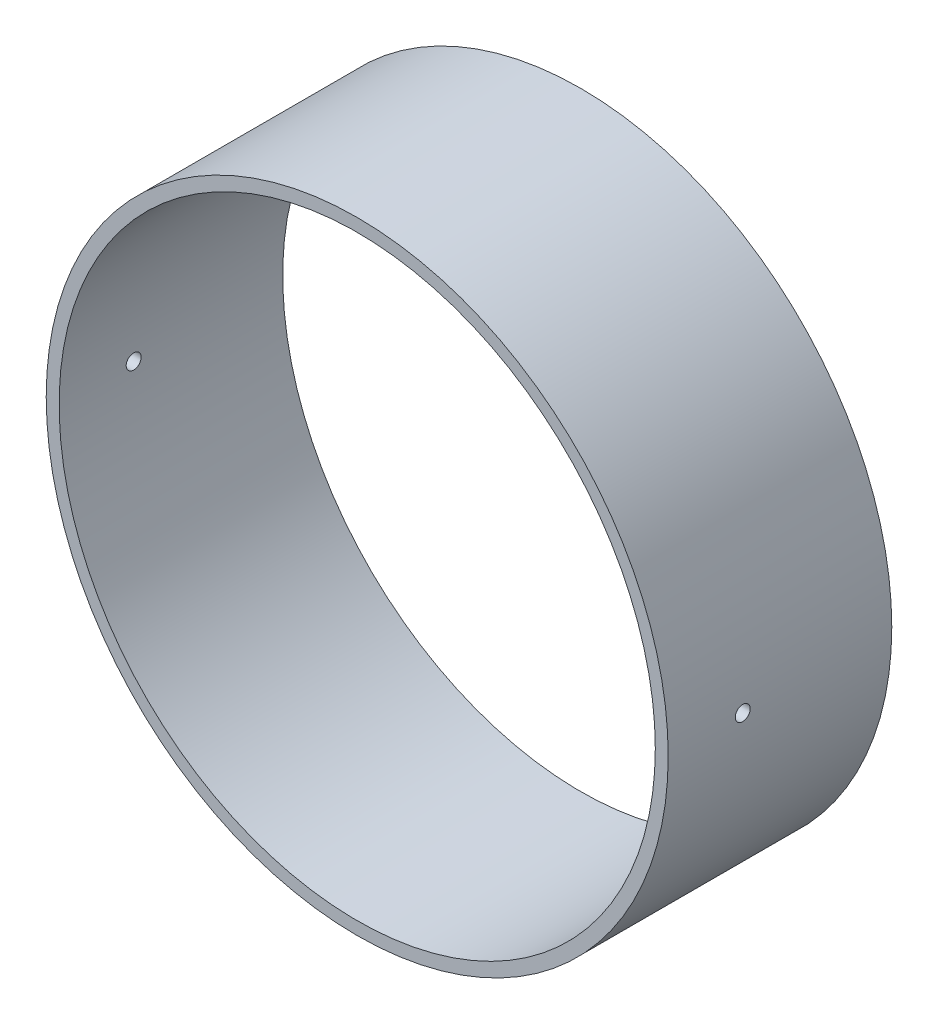
ISO-10303-21;
HEADER;
FILE_DESCRIPTION(('STEP AP214'),'2;1');
FILE_NAME('part.step','',(''),(''),'','','');
FILE_SCHEMA(('AUTOMOTIVE_DESIGN { 1 0 10303 214 1 1 1 1 }'));
ENDSEC;
DATA;
#1=APPLICATION_CONTEXT('core data for automotive mechanical design processes');
#2=APPLICATION_PROTOCOL_DEFINITION('international standard','automotive_design',2000,#1);
#3=PRODUCT_CONTEXT('',#1,'mechanical');
#4=PRODUCT('Part','Part','',(#3));
#5=PRODUCT_RELATED_PRODUCT_CATEGORY('part','',(#4));
#6=PRODUCT_DEFINITION_FORMATION('','',#4);
#7=PRODUCT_DEFINITION_CONTEXT('part definition',#1,'design');
#8=PRODUCT_DEFINITION('design','',#6,#7);
#9=PRODUCT_DEFINITION_SHAPE('','',#8);
#10=(LENGTH_UNIT() NAMED_UNIT(*) SI_UNIT(.MILLI.,.METRE.));
#11=(NAMED_UNIT(*) PLANE_ANGLE_UNIT() SI_UNIT($,.RADIAN.));
#12=(NAMED_UNIT(*) SI_UNIT($,.STERADIAN.) SOLID_ANGLE_UNIT());
#13=UNCERTAINTY_MEASURE_WITH_UNIT(LENGTH_MEASURE(1.E-05),#10,'distance_accuracy_value','');
#14=(GEOMETRIC_REPRESENTATION_CONTEXT(3) GLOBAL_UNCERTAINTY_ASSIGNED_CONTEXT((#13)) GLOBAL_UNIT_ASSIGNED_CONTEXT((#10,
#11,#12)) REPRESENTATION_CONTEXT('',''));
#15=CARTESIAN_POINT('',(0.,0.,0.));
#16=DIRECTION('',(0.,0.,1.));
#17=DIRECTION('',(1.,0.,0.));
#18=AXIS2_PLACEMENT_3D('',#15,#16,#17);
#19=CARTESIAN_POINT('',(0.,0.,28.575));
#20=DIRECTION('',(0.,0.,1.));
#21=DIRECTION('',(1.,0.,0.));
#22=AXIS2_PLACEMENT_3D('',#19,#20,#21);
#23=PLANE('',#22);
#24=CARTESIAN_POINT('',(0.,0.,28.575));
#25=DIRECTION('',(0.,0.,1.));
#26=DIRECTION('',(1.,0.,0.));
#27=AXIS2_PLACEMENT_3D('',#24,#25,#26);
#28=CIRCLE('',#27,39.75);
#29=CARTESIAN_POINT('',(39.75,0.,28.575));
#30=VERTEX_POINT('',#29);
#31=EDGE_CURVE('E10',#30,#30,#28,.T.);
#32=ORIENTED_EDGE('',*,*,#31,.T.);
#33=EDGE_LOOP('',(#32));
#34=FACE_BOUND('',#33,.T.);
#35=CARTESIAN_POINT('',(0.,0.,28.575));
#36=DIRECTION('',(0.,0.,1.));
#37=DIRECTION('',(1.,0.,0.));
#38=AXIS2_PLACEMENT_3D('',#35,#36,#37);
#39=CIRCLE('',#38,38.1);
#40=CARTESIAN_POINT('',(38.1,0.,28.575));
#41=VERTEX_POINT('',#40);
#42=EDGE_CURVE('E53',#41,#41,#39,.T.);
#43=ORIENTED_EDGE('',*,*,#42,.F.);
#44=EDGE_LOOP('',(#43));
#45=FACE_BOUND('',#44,.T.);
#46=ADVANCED_FACE('F34',(#34,#45),#23,.T.);
#47=CARTESIAN_POINT('',(0.,0.,0.));
#48=DIRECTION('',(0.,0.,1.));
#49=DIRECTION('',(1.,0.,0.));
#50=AXIS2_PLACEMENT_3D('',#47,#48,#49);
#51=PLANE('',#50);
#52=CARTESIAN_POINT('',(0.,0.,0.));
#53=DIRECTION('',(0.,0.,1.));
#54=DIRECTION('',(1.,0.,0.));
#55=AXIS2_PLACEMENT_3D('',#52,#53,#54);
#56=CIRCLE('',#55,39.75);
#57=CARTESIAN_POINT('',(39.75,0.,0.));
#58=VERTEX_POINT('',#57);
#59=EDGE_CURVE('E48',#58,#58,#56,.T.);
#60=ORIENTED_EDGE('',*,*,#59,.F.);
#61=EDGE_LOOP('',(#60));
#62=FACE_BOUND('',#61,.T.);
#63=CARTESIAN_POINT('',(0.,0.,0.));
#64=DIRECTION('',(0.,0.,1.));
#65=DIRECTION('',(1.,0.,0.));
#66=AXIS2_PLACEMENT_3D('',#63,#64,#65);
#67=CIRCLE('',#66,38.1);
#68=CARTESIAN_POINT('',(38.1,0.,0.));
#69=VERTEX_POINT('',#68);
#70=EDGE_CURVE('E56',#69,#69,#67,.T.);
#71=ORIENTED_EDGE('',*,*,#70,.T.);
#72=EDGE_LOOP('',(#71));
#73=FACE_BOUND('',#72,.T.);
#74=ADVANCED_FACE('F92',(#62,#73),#51,.F.);
#75=CARTESIAN_POINT('',(0.,0.,28.575));
#76=DIRECTION('',(0.,0.,-1.));
#77=DIRECTION('',(-1.,0.,0.));
#78=AXIS2_PLACEMENT_3D('',#75,#76,#77);
#79=CYLINDRICAL_SURFACE('',#78,39.75);
#80=CARTESIAN_POINT('',(39.75,0.,20.0025));
#81=CARTESIAN_POINT('',(39.7499998460365,0.053494104663573,20.0024976302836));
#82=CARTESIAN_POINT('',(39.7498908555501,0.107026802117876,19.9979783883989));
#83=CARTESIAN_POINT('',(39.7494665485141,0.212617313597878,19.9800132651465));
#84=CARTESIAN_POINT('',(39.7491509848299,0.264673283008032,19.9665566912854));
#85=CARTESIAN_POINT('',(39.7483492722617,0.365765353174802,19.9311007087586));
#86=CARTESIAN_POINT('',(39.7478632061248,0.414802905265441,19.9091054434863));
#87=CARTESIAN_POINT('',(39.7467753330846,0.508475773654119,19.8572022954957));
#88=CARTESIAN_POINT('',(39.7461735546353,0.553112168139593,19.8272963573639));
#89=CARTESIAN_POINT('',(39.7449217984111,0.636744787477263,19.760408393355));
#90=CARTESIAN_POINT('',(39.744271807001,0.675739407496198,19.7234243609975));
#91=CARTESIAN_POINT('',(39.7429970046479,0.746968176136346,19.6434332203757));
#92=CARTESIAN_POINT('',(39.7423721947034,0.779202056879612,19.6004258735646));
#93=CARTESIAN_POINT('',(39.7412181644531,0.835995645710772,19.5096045128951));
#94=CARTESIAN_POINT('',(39.7406889538771,0.860554572850182,19.4617900105487));
#95=CARTESIAN_POINT('',(39.7397858982121,0.901295957044684,19.3627151380246));
#96=CARTESIAN_POINT('',(39.7394120526126,0.917478441626887,19.3114547791715));
#97=CARTESIAN_POINT('',(39.7388619640907,0.941004629387772,19.2069537232027));
#98=CARTESIAN_POINT('',(39.738685683097,0.948350035519394,19.1537134096744));
#99=CARTESIAN_POINT('',(39.7385504850494,0.953998796121277,19.0467551065655));
#100=CARTESIAN_POINT('',(39.7385915673001,0.952302179515943,18.9930371185135));
#101=CARTESIAN_POINT('',(39.738886427485,0.939916515238613,18.8866598825534));
#102=CARTESIAN_POINT('',(39.7391401617592,0.929229313435194,18.8340004195903));
#103=CARTESIAN_POINT('',(39.7398316528361,0.899168700884327,18.7312232708817));
#104=CARTESIAN_POINT('',(39.7402694099676,0.879795274613089,18.6811055896789));
#105=CARTESIAN_POINT('',(39.7412796470828,0.832910038955143,18.584828760083));
#106=CARTESIAN_POINT('',(39.7418521410799,0.805397382961803,18.5386700241264));
#107=CARTESIAN_POINT('',(39.7430672972813,0.743015313990828,18.4516259072517));
#108=CARTESIAN_POINT('',(39.7437099595777,0.708145891364704,18.4107405332498));
#109=CARTESIAN_POINT('',(39.7449931969159,0.632029655786516,18.335392965578));
#110=CARTESIAN_POINT('',(39.7456337713918,0.590781240555827,18.3009323905022));
#111=CARTESIAN_POINT('',(39.7468404620925,0.503083577535561,18.2394250992597));
#112=CARTESIAN_POINT('',(39.7474065783063,0.45663432896882,18.2123783842009));
#113=CARTESIAN_POINT('',(39.7484005376143,0.359852650913566,18.1664667675409));
#114=CARTESIAN_POINT('',(39.7488283798699,0.309520197873244,18.1476019155676));
#115=CARTESIAN_POINT('',(39.7494975460588,0.206401283685805,18.118590563217));
#116=CARTESIAN_POINT('',(39.749738870319,0.153614826840126,18.1084440475586));
#117=CARTESIAN_POINT('',(39.7500077544224,0.0471004004104377,18.0971593736529));
#118=CARTESIAN_POINT('',(39.7500353674039,-0.00662733180007495,18.0960189760795));
#119=CARTESIAN_POINT('',(39.7498738568161,-0.113511507883781,18.1027730765356));
#120=CARTESIAN_POINT('',(39.7496847334035,-0.166667952169796,18.1106675680359));
#121=CARTESIAN_POINT('',(39.7491111015279,-0.270894381174725,18.135265495612));
#122=CARTESIAN_POINT('',(39.748726615588,-0.321964605679448,18.1519679162357));
#123=CARTESIAN_POINT('',(39.7478055924139,-0.420576236824629,18.193706544643));
#124=CARTESIAN_POINT('',(39.7472690549916,-0.468117639102438,18.2187427627294));
#125=CARTESIAN_POINT('',(39.7461042557672,-0.55833239751617,18.276444063584));
#126=CARTESIAN_POINT('',(39.7454759758439,-0.601004788942966,18.3091106542834));
#127=CARTESIAN_POINT('',(39.7441985687771,-0.680260520118648,18.3811431955905));
#128=CARTESIAN_POINT('',(39.7435494415964,-0.716843849058312,18.4205091580906));
#129=CARTESIAN_POINT('',(39.7423033692423,-0.782890439107276,18.5048325660628));
#130=CARTESIAN_POINT('',(39.7417064346742,-0.812352255283334,18.5497911434614));
#131=CARTESIAN_POINT('',(39.7406322155955,-0.863309610126898,18.6440177548333));
#132=CARTESIAN_POINT('',(39.740154930867,-0.884805163297402,18.6932857809608));
#133=CARTESIAN_POINT('',(39.7393738988802,-0.919217286930498,18.7947272918023));
#134=CARTESIAN_POINT('',(39.7390701326409,-0.932134795759579,18.8469004580414));
#135=CARTESIAN_POINT('',(39.7386703324535,-0.949027230103611,18.952675787155));
#136=CARTESIAN_POINT('',(39.7385742985246,-0.95300215479436,19.0062779501613));
#137=CARTESIAN_POINT('',(39.7386007975025,-0.951896465994101,19.1133751589298));
#138=CARTESIAN_POINT('',(39.738723275277,-0.946818136715644,19.1668702283035));
#139=CARTESIAN_POINT('',(39.7391728744335,-0.927754779863062,19.2722483061791));
#140=CARTESIAN_POINT('',(39.7394999962235,-0.913769734530126,19.3241313114665));
#141=CARTESIAN_POINT('',(39.7403220002089,-0.877290123585656,19.4248136666695));
#142=CARTESIAN_POINT('',(39.7408168853695,-0.854795407564792,19.4736129620625));
#143=CARTESIAN_POINT('',(39.7419186022703,-0.801936135858363,19.5667410101382));
#144=CARTESIAN_POINT('',(39.7425254298364,-0.771571873596423,19.6110699294177));
#145=CARTESIAN_POINT('',(39.7437827568947,-0.703830052350616,19.6940085564152));
#146=CARTESIAN_POINT('',(39.7444332627452,-0.666451470854739,19.7326174288234));
#147=CARTESIAN_POINT('',(39.7457047180014,-0.585732141955894,19.8030222194704));
#148=CARTESIAN_POINT('',(39.7463256600385,-0.542389918534343,19.8348164460662));
#149=CARTESIAN_POINT('',(39.7474681589653,-0.450960100766693,19.8906929330673));
#150=CARTESIAN_POINT('',(39.7479896573869,-0.40286973980615,19.9147706621693));
#151=CARTESIAN_POINT('',(39.7488733756499,-0.303365300168541,19.9544825926952));
#152=CARTESIAN_POINT('',(39.7492357856961,-0.251955275314471,19.970126882199));
#153=CARTESIAN_POINT('',(39.74966342885,-0.166849540723217,19.9883733944774));
#154=CARTESIAN_POINT('',(39.7497890968184,-0.133706454605323,19.9936642255806));
#155=CARTESIAN_POINT('',(39.7499574306394,-0.0670473000409005,20.0007282707082));
#156=CARTESIAN_POINT('',(39.7500000965076,-0.0335312316638731,20.0025014853881));
#157=CARTESIAN_POINT('',(39.75,0.,20.0025));
#158=B_SPLINE_CURVE_WITH_KNOTS('',3,(#80,#81,#82,#83,#84,#85,#86,#87,#88,#89,#90,#91,#92,#93,
#94,#95,#96,#97,#98,#99,#100,#101,#102,#103,#104,#105,#106,#107,#108,#109,#110,#111,#112,#113,
#114,#115,#116,#117,#118,#119,#120,#121,#122,#123,#124,#125,#126,#127,#128,#129,#130,#131,#132,
#133,#134,#135,#136,#137,#138,#139,#140,#141,#142,#143,#144,#145,#146,#147,#148,#149,#150,#151,
#152,#153,#154,#155,#156,#157),.UNSPECIFIED.,.T.,.F.,(4,2,2,2,2,2,2,2,2,2,2,2,2,2,2,2,2,2,2,2,2,
2,2,2,2,2,2,2,2,2,2,2,2,2,2,2,2,2,4),(0.,0.160359922254081,0.320912043203712,0.481386353547739,
0.641821253005189,0.802301699688268,0.962788503820298,1.12329163263074,1.28379423398393,
1.44426590065867,1.60473705400308,1.76517526884771,1.92561377042442,2.08606896597464,
2.24652437196514,2.40702014688433,2.56751594578658,2.72801271817964,2.88850920926067,
3.04896579243571,3.20942225965442,3.36986023214588,3.53029840298194,3.69076830683191,
3.85123849554285,4.01174121588789,4.17224364402792,4.33272851164775,4.49321339405882,
4.65365779050726,4.81410250686156,4.97455005922573,5.13499163000856,5.29545660734695,
5.4559613719104,5.61656021656189,5.77696652418033,5.87748352018328,5.97800049745618),.UNSPECIFIED.);
#159=CARTESIAN_POINT('',(39.75,0.,20.0025));
#160=VERTEX_POINT('',#159);
#161=EDGE_CURVE('E81',#160,#160,#158,.T.);
#162=ORIENTED_EDGE('',*,*,#161,.T.);
#163=EDGE_LOOP('',(#162));
#164=FACE_BOUND('',#163,.T.);
#165=CARTESIAN_POINT('',(-39.75,0.,20.0025));
#166=CARTESIAN_POINT('',(-39.7499998460365,-0.0534941046635731,20.0024976302836));
#167=CARTESIAN_POINT('',(-39.7498908555501,-0.107026802117876,19.9979783883989));
#168=CARTESIAN_POINT('',(-39.7494665485141,-0.212617313597879,19.9800132651465));
#169=CARTESIAN_POINT('',(-39.7491509848299,-0.264673283008033,19.9665566912854));
#170=CARTESIAN_POINT('',(-39.7483492722617,-0.365765353174802,19.9311007087586));
#171=CARTESIAN_POINT('',(-39.7478632061248,-0.414802905265441,19.9091054434863));
#172=CARTESIAN_POINT('',(-39.7467753330846,-0.50847577365412,19.8572022954957));
#173=CARTESIAN_POINT('',(-39.7461735546353,-0.553112168139594,19.8272963573639));
#174=CARTESIAN_POINT('',(-39.7449217984111,-0.636744787477264,19.760408393355));
#175=CARTESIAN_POINT('',(-39.744271807001,-0.675739407496199,19.7234243609975));
#176=CARTESIAN_POINT('',(-39.7429970046479,-0.746968176136347,19.6434332203757));
#177=CARTESIAN_POINT('',(-39.7423721947034,-0.779202056879612,19.6004258735646));
#178=CARTESIAN_POINT('',(-39.7412181644531,-0.835995645710773,19.5096045128951));
#179=CARTESIAN_POINT('',(-39.7406889538771,-0.860554572850184,19.4617900105487));
#180=CARTESIAN_POINT('',(-39.7397858982121,-0.901295957044687,19.3627151380246));
#181=CARTESIAN_POINT('',(-39.7394120526126,-0.917478441626889,19.3114547791715));
#182=CARTESIAN_POINT('',(-39.7388619640907,-0.941004629387772,19.2069537232027));
#183=CARTESIAN_POINT('',(-39.738685683097,-0.948350035519394,19.1537134096744));
#184=CARTESIAN_POINT('',(-39.7385504850494,-0.953998796121277,19.0467551065655));
#185=CARTESIAN_POINT('',(-39.7385915673001,-0.952302179515943,18.9930371185135));
#186=CARTESIAN_POINT('',(-39.738886427485,-0.939916515238613,18.8866598825534));
#187=CARTESIAN_POINT('',(-39.7391401617592,-0.929229313435194,18.8340004195903));
#188=CARTESIAN_POINT('',(-39.7398316528361,-0.899168700884327,18.7312232708817));
#189=CARTESIAN_POINT('',(-39.7402694099676,-0.879795274613089,18.6811055896789));
#190=CARTESIAN_POINT('',(-39.7412796470828,-0.832910038955143,18.584828760083));
#191=CARTESIAN_POINT('',(-39.7418521410799,-0.805397382961803,18.5386700241264));
#192=CARTESIAN_POINT('',(-39.7430672972813,-0.743015313990828,18.4516259072517));
#193=CARTESIAN_POINT('',(-39.7437099595777,-0.708145891364704,18.4107405332498));
#194=CARTESIAN_POINT('',(-39.7449931969159,-0.632029655786516,18.335392965578));
#195=CARTESIAN_POINT('',(-39.7456337713918,-0.590781240555827,18.3009323905022));
#196=CARTESIAN_POINT('',(-39.7468404620925,-0.503083577535561,18.2394250992597));
#197=CARTESIAN_POINT('',(-39.7474065783063,-0.45663432896882,18.2123783842009));
#198=CARTESIAN_POINT('',(-39.7484005376143,-0.359852650913566,18.1664667675409));
#199=CARTESIAN_POINT('',(-39.7488283798699,-0.309520197873244,18.1476019155676));
#200=CARTESIAN_POINT('',(-39.7494975460588,-0.206401283685805,18.118590563217));
#201=CARTESIAN_POINT('',(-39.749738870319,-0.153614826840126,18.1084440475586));
#202=CARTESIAN_POINT('',(-39.7500077544224,-0.0471004004104377,18.0971593736529));
#203=CARTESIAN_POINT('',(-39.7500353674039,0.00662733180007494,18.0960189760795));
#204=CARTESIAN_POINT('',(-39.7498738568161,0.113511507883781,18.1027730765356));
#205=CARTESIAN_POINT('',(-39.7496847334035,0.166667952169796,18.1106675680359));
#206=CARTESIAN_POINT('',(-39.7491111015279,0.270894381174725,18.135265495612));
#207=CARTESIAN_POINT('',(-39.748726615588,0.321964605679448,18.1519679162357));
#208=CARTESIAN_POINT('',(-39.7478055924139,0.420576236824629,18.193706544643));
#209=CARTESIAN_POINT('',(-39.7472690549916,0.468117639102438,18.2187427627294));
#210=CARTESIAN_POINT('',(-39.7461042557672,0.55833239751617,18.276444063584));
#211=CARTESIAN_POINT('',(-39.7454759758439,0.601004788942967,18.3091106542834));
#212=CARTESIAN_POINT('',(-39.7441985687771,0.680260520118648,18.3811431955905));
#213=CARTESIAN_POINT('',(-39.7435494415964,0.716843849058312,18.4205091580906));
#214=CARTESIAN_POINT('',(-39.7423033692423,0.782890439107276,18.5048325660628));
#215=CARTESIAN_POINT('',(-39.7417064346742,0.812352255283334,18.5497911434614));
#216=CARTESIAN_POINT('',(-39.7406322155955,0.863309610126898,18.6440177548333));
#217=CARTESIAN_POINT('',(-39.740154930867,0.884805163297402,18.6932857809608));
#218=CARTESIAN_POINT('',(-39.7393738988802,0.919217286930498,18.7947272918023));
#219=CARTESIAN_POINT('',(-39.7390701326409,0.932134795759579,18.8469004580414));
#220=CARTESIAN_POINT('',(-39.7386703324535,0.949027230103611,18.952675787155));
#221=CARTESIAN_POINT('',(-39.7385742985246,0.95300215479436,19.0062779501613));
#222=CARTESIAN_POINT('',(-39.7386007975025,0.951896465994101,19.1133751589298));
#223=CARTESIAN_POINT('',(-39.738723275277,0.946818136715644,19.1668702283035));
#224=CARTESIAN_POINT('',(-39.7391728744335,0.927754779863062,19.2722483061791));
#225=CARTESIAN_POINT('',(-39.7394999962235,0.913769734530126,19.3241313114665));
#226=CARTESIAN_POINT('',(-39.7403220002089,0.877290123585656,19.4248136666695));
#227=CARTESIAN_POINT('',(-39.7408168853695,0.854795407564792,19.4736129620625));
#228=CARTESIAN_POINT('',(-39.7419186022703,0.801936135858363,19.5667410101382));
#229=CARTESIAN_POINT('',(-39.7425254298364,0.771571873596423,19.6110699294177));
#230=CARTESIAN_POINT('',(-39.7437827568947,0.703830052350616,19.6940085564152));
#231=CARTESIAN_POINT('',(-39.7444332627452,0.666451470854739,19.7326174288234));
#232=CARTESIAN_POINT('',(-39.7457047180014,0.585732141955894,19.8030222194704));
#233=CARTESIAN_POINT('',(-39.7463256600385,0.542389918534343,19.8348164460662));
#234=CARTESIAN_POINT('',(-39.7474681589653,0.450960100766693,19.8906929330673));
#235=CARTESIAN_POINT('',(-39.7479896573869,0.40286973980615,19.9147706621693));
#236=CARTESIAN_POINT('',(-39.7488733756499,0.303365300168541,19.9544825926952));
#237=CARTESIAN_POINT('',(-39.7492357856961,0.251955275314472,19.970126882199));
#238=CARTESIAN_POINT('',(-39.74966342885,0.166849540723218,19.9883733944774));
#239=CARTESIAN_POINT('',(-39.7497890968184,0.133706454605324,19.9936642255806));
#240=CARTESIAN_POINT('',(-39.7499574306394,0.0670473000409009,20.0007282707082));
#241=CARTESIAN_POINT('',(-39.7500000965075,0.0335312316638732,20.0025014853881));
#242=CARTESIAN_POINT('',(-39.75,0.,20.0025));
#243=B_SPLINE_CURVE_WITH_KNOTS('',3,(#165,#166,#167,#168,#169,#170,#171,#172,#173,#174,#175,
#176,#177,#178,#179,#180,#181,#182,#183,#184,#185,#186,#187,#188,#189,#190,#191,#192,#193,#194,
#195,#196,#197,#198,#199,#200,#201,#202,#203,#204,#205,#206,#207,#208,#209,#210,#211,#212,#213,
#214,#215,#216,#217,#218,#219,#220,#221,#222,#223,#224,#225,#226,#227,#228,#229,#230,#231,#232,
#233,#234,#235,#236,#237,#238,#239,#240,#241,#242),.UNSPECIFIED.,.T.,.F.,(4,2,2,2,2,2,2,2,2,2,2,
2,2,2,2,2,2,2,2,2,2,2,2,2,2,2,2,2,2,2,2,2,2,2,2,2,2,2,4),(0.,0.160359922254081,
0.320912043203712,0.481386353547739,0.64182125300519,0.802301699688268,0.962788503820298,
1.12329163263075,1.28379423398393,1.44426590065867,1.60473705400308,1.76517526884771,
1.92561377042442,2.08606896597464,2.24652437196514,2.40702014688433,2.56751594578658,
2.72801271817964,2.88850920926067,3.04896579243571,3.20942225965442,3.36986023214588,
3.53029840298194,3.69076830683192,3.85123849554285,4.01174121588789,4.17224364402792,
4.33272851164775,4.49321339405882,4.65365779050726,4.81410250686156,4.97455005922573,
5.13499163000856,5.29545660734696,5.4559613719104,5.61656021656189,5.77696652418033,
5.87748352018328,5.97800049745618),.UNSPECIFIED.);
#244=CARTESIAN_POINT('',(-39.75,0.,20.0025));
#245=VERTEX_POINT('',#244);
#246=EDGE_CURVE('E76',#245,#245,#243,.T.);
#247=ORIENTED_EDGE('',*,*,#246,.T.);
#248=EDGE_LOOP('',(#247));
#249=FACE_BOUND('',#248,.T.);
#250=ORIENTED_EDGE('',*,*,#31,.F.);
#251=EDGE_LOOP('',(#250));
#252=FACE_BOUND('',#251,.T.);
#253=ORIENTED_EDGE('',*,*,#59,.T.);
#254=EDGE_LOOP('',(#253));
#255=FACE_BOUND('',#254,.T.);
#256=ADVANCED_FACE('F36',(#164,#249,#252,#255),#79,.T.);
#257=CARTESIAN_POINT('',(0.,0.,28.575));
#258=DIRECTION('',(0.,0.,-1.));
#259=DIRECTION('',(-1.,0.,0.));
#260=AXIS2_PLACEMENT_3D('',#257,#258,#259);
#261=CYLINDRICAL_SURFACE('',#260,38.1);
#262=CARTESIAN_POINT('',(-38.1,0.,20.0025));
#263=CARTESIAN_POINT('',(-38.0999998394034,-0.0534933758212777,20.0024976305368));
#264=CARTESIAN_POINT('',(-38.0998861319876,-0.107025326605558,19.9979785113148));
#265=CARTESIAN_POINT('',(-38.0994434616455,-0.212614315328817,19.980013903684));
#266=CARTESIAN_POINT('',(-38.0991142410001,-0.264669509447058,19.9665577277156));
#267=CARTESIAN_POINT('',(-38.0982778311845,-0.365760025123645,19.9311028642396));
#268=CARTESIAN_POINT('',(-38.097770728459,-0.414796799949938,19.9091083255347));
#269=CARTESIAN_POINT('',(-38.0966357697414,-0.508468267890521,19.8572069550902));
#270=CARTESIAN_POINT('',(-38.0960079434046,-0.553104038032876,19.8273020658273));
#271=CARTESIAN_POINT('',(-38.0947019879638,-0.636736353013983,19.7604159329871));
#272=CARTESIAN_POINT('',(-38.0940238438379,-0.675731203475066,19.7234325709477));
#273=CARTESIAN_POINT('',(-38.0926938176742,-0.746960600430134,19.6434427311675));
#274=CARTESIAN_POINT('',(-38.0920419366788,-0.779194878839908,19.6004360146889));
#275=CARTESIAN_POINT('',(-38.0908378896239,-0.835989745853541,19.50961528509));
#276=CARTESIAN_POINT('',(-38.090285734779,-0.860549471650082,19.4618007322494));
#277=CARTESIAN_POINT('',(-38.0893435190447,-0.901292392209042,19.3627254900183));
#278=CARTESIAN_POINT('',(-38.0889534576043,-0.917475615445504,19.3114648123429));
#279=CARTESIAN_POINT('',(-38.088379506336,-0.941002929050601,19.2069637953965));
#280=CARTESIAN_POINT('',(-38.0881955732392,-0.948348874496709,19.1537238740183));
#281=CARTESIAN_POINT('',(-38.0880544871761,-0.953998816555586,19.0467662366796));
#282=CARTESIAN_POINT('',(-38.0880973334563,-0.952302843210569,18.9930485223071));
#283=CARTESIAN_POINT('',(-38.0884049341284,-0.93991867580528,18.8866727381089));
#284=CARTESIAN_POINT('',(-38.0886696389277,-0.929232491346884,18.8340144341642));
#285=CARTESIAN_POINT('',(-38.0893910375643,-0.899174348693302,18.7312394323348));
#286=CARTESIAN_POINT('',(-38.0898477317572,-0.879802374413717,18.6811227391568));
#287=CARTESIAN_POINT('',(-38.0909016818389,-0.83292024827479,18.5848471548106));
#288=CARTESIAN_POINT('',(-38.0914989536445,-0.805409174784861,18.5386887126188));
#289=CARTESIAN_POINT('',(-38.0927667094265,-0.743030485481414,18.4516448426716));
#290=CARTESIAN_POINT('',(-38.09343719351,-0.708162858902927,18.4107594226324));
#291=CARTESIAN_POINT('',(-38.0947760087668,-0.632049453610372,18.3354104707446));
#292=CARTESIAN_POINT('',(-38.0954443393002,-0.590801930851814,18.3009487005987));
#293=CARTESIAN_POINT('',(-38.0967033266883,-0.50310576435069,18.2394388621667));
#294=CARTESIAN_POINT('',(-38.0972939835312,-0.456657119821136,18.2123907950024));
#295=CARTESIAN_POINT('',(-38.0983310433418,-0.359876262302034,18.1664763699501));
#296=CARTESIAN_POINT('',(-38.0987774453532,-0.309544023570463,18.1476100662996));
#297=CARTESIAN_POINT('',(-38.0994756565541,-0.206425179006079,18.1185958389361));
#298=CARTESIAN_POINT('',(-38.0997274661141,-0.153638577846346,18.1084478986242));
#299=CARTESIAN_POINT('',(-38.1000080589303,-0.0471247501574903,18.0971606195704));
#300=CARTESIAN_POINT('',(-38.1000369025289,0.00660221793027332,18.0960188434456));
#301=CARTESIAN_POINT('',(-38.0998684716746,0.113485093888877,18.1027699537839));
#302=CARTESIAN_POINT('',(-38.0996711974006,0.166641002211201,18.1106628331034));
#303=CARTESIAN_POINT('',(-38.099072805225,0.270866051422862,18.1352571853253));
#304=CARTESIAN_POINT('',(-38.0986717129064,0.321935453337854,18.1519575527373));
#305=CARTESIAN_POINT('',(-38.0977108887346,0.420545809052824,18.1936916912852));
#306=CARTESIAN_POINT('',(-38.0971511566662,0.468086758065295,18.218725473728));
#307=CARTESIAN_POINT('',(-38.0959359727681,0.558301905103113,18.2764220993329));
#308=CARTESIAN_POINT('',(-38.0952805003585,0.600975053243567,18.3090865836682));
#309=CARTESIAN_POINT('',(-38.0939477845698,0.680232716421629,18.3811149729543));
#310=CARTESIAN_POINT('',(-38.0932705411493,0.716817219910605,18.4204788906119));
#311=CARTESIAN_POINT('',(-38.0919704614062,0.782867208257814,18.5047991780167));
#312=CARTESIAN_POINT('',(-38.0913476371221,0.812331120425496,18.5497567798985));
#313=CARTESIAN_POINT('',(-38.0902268053137,0.863292785753061,18.6439819304929));
#314=CARTESIAN_POINT('',(-38.0897287975536,0.884790553953169,18.693249471068));
#315=CARTESIAN_POINT('',(-38.0889138330889,0.919206938385095,18.7946900354521));
#316=CARTESIAN_POINT('',(-38.088596854844,0.932126575343715,18.8468627127728));
#317=CARTESIAN_POINT('',(-38.0881796267664,0.949023305775365,18.9526374956039));
#318=CARTESIAN_POINT('',(-38.0880793769209,0.95300039977925,19.0062396010296));
#319=CARTESIAN_POINT('',(-38.0881069164249,0.951899020536146,19.1133358604886));
#320=CARTESIAN_POINT('',(-38.0882346431977,0.946823032243722,19.1668300401114));
#321=CARTESIAN_POINT('',(-38.0887036053721,0.927764676381259,19.2722067169993));
#322=CARTESIAN_POINT('',(-38.0890448411991,0.913782291068281,19.3240892110534));
#323=CARTESIAN_POINT('',(-38.0899023458855,0.877308289358,19.4247709685769));
#324=CARTESIAN_POINT('',(-38.0904186178156,0.854816523672506,19.4735701779356));
#325=CARTESIAN_POINT('',(-38.0915679694282,0.801963373022081,19.5666985995506));
#326=CARTESIAN_POINT('',(-38.0922010447756,0.771602280095278,19.6110279776018));
#327=CARTESIAN_POINT('',(-38.0935127929822,0.703866130348107,19.6939691053473));
#328=CARTESIAN_POINT('',(-38.0941914734862,0.66648989567146,19.7325798929283));
#329=CARTESIAN_POINT('',(-38.0955180209982,0.585774910345128,19.8029889335503));
#330=CARTESIAN_POINT('',(-38.0961658803259,0.542434683902575,19.8347854954119));
#331=CARTESIAN_POINT('',(-38.0973579375821,0.451007920894043,19.8906673010506));
#332=CARTESIAN_POINT('',(-38.0979020735175,0.402918571789243,19.9147479390185));
#333=CARTESIAN_POINT('',(-38.0988241829392,0.303415501933353,19.9544657812059));
#334=CARTESIAN_POINT('',(-38.0992023547909,0.252005834548171,19.9701130703665));
#335=CARTESIAN_POINT('',(-38.0996486733003,0.166892109894127,19.9883661320491));
#336=CARTESIAN_POINT('',(-38.0997798504214,0.133740694177747,19.9936596800738));
#337=CARTESIAN_POINT('',(-38.0999555641088,0.0670645737586451,20.000727356508));
#338=CARTESIAN_POINT('',(-38.1000001006926,0.0335398691317386,20.0025014856323));
#339=CARTESIAN_POINT('',(-38.1,0.,20.0025));
#340=B_SPLINE_CURVE_WITH_KNOTS('',3,(#262,#263,#264,#265,#266,#267,#268,#269,#270,#271,#272,
#273,#274,#275,#276,#277,#278,#279,#280,#281,#282,#283,#284,#285,#286,#287,#288,#289,#290,#291,
#292,#293,#294,#295,#296,#297,#298,#299,#300,#301,#302,#303,#304,#305,#306,#307,#308,#309,#310,
#311,#312,#313,#314,#315,#316,#317,#318,#319,#320,#321,#322,#323,#324,#325,#326,#327,#328,#329,
#330,#331,#332,#333,#334,#335,#336,#337,#338,#339),.UNSPECIFIED.,.T.,.F.,(4,2,2,2,2,2,2,2,2,2,2,
2,2,2,2,2,2,2,2,2,2,2,2,2,2,2,2,2,2,2,2,2,2,2,2,2,2,2,4),(0.,0.16035770394741,0.3209075210132,
0.481379424137878,0.641811958077457,0.80229258193401,0.962779568298115,1.12328459083667,
1.28378906777079,1.44425984651979,1.60473009209719,1.76516447693168,1.92559915886078,
2.08605201456276,2.24650510505975,2.40700213569576,2.5674991906168,2.72799730946822,
2.88849512274539,3.04894949821499,3.20940374681898,3.36983786046077,3.53027219178027,
3.69074106033356,3.85121023325259,4.01171481589687,4.17221909550403,4.33270427300257,
4.49318944097424,4.65363056461234,4.81407200787533,4.97451626604642,5.13495457083266,
5.29541983766702,5.45592488335759,5.616525560418,5.77693375612691,5.87747662549021,
5.97801947443344),.UNSPECIFIED.);
#341=CARTESIAN_POINT('',(-38.1,0.,20.0025));
#342=VERTEX_POINT('',#341);
#343=EDGE_CURVE('E39',#342,#342,#340,.T.);
#344=ORIENTED_EDGE('',*,*,#343,.F.);
#345=EDGE_LOOP('',(#344));
#346=FACE_BOUND('',#345,.T.);
#347=CARTESIAN_POINT('',(38.1,0.,20.0025));
#348=CARTESIAN_POINT('',(38.0999998394034,0.0534933758212775,20.0024976305368));
#349=CARTESIAN_POINT('',(38.0998861319877,0.107025326605558,19.9979785113148));
#350=CARTESIAN_POINT('',(38.0994434616455,0.212614315328817,19.980013903684));
#351=CARTESIAN_POINT('',(38.0991142410001,0.264669509447058,19.9665577277156));
#352=CARTESIAN_POINT('',(38.0982778311845,0.365760025123645,19.9311028642396));
#353=CARTESIAN_POINT('',(38.097770728459,0.414796799949938,19.9091083255347));
#354=CARTESIAN_POINT('',(38.0966357697414,0.508468267890521,19.8572069550902));
#355=CARTESIAN_POINT('',(38.0960079434046,0.553104038032876,19.8273020658273));
#356=CARTESIAN_POINT('',(38.0947019879638,0.636736353013983,19.7604159329871));
#357=CARTESIAN_POINT('',(38.0940238438379,0.675731203475067,19.7234325709477));
#358=CARTESIAN_POINT('',(38.0926938176742,0.746960600430135,19.6434427311675));
#359=CARTESIAN_POINT('',(38.0920419366788,0.779194878839907,19.6004360146889));
#360=CARTESIAN_POINT('',(38.0908378896239,0.83598974585354,19.50961528509));
#361=CARTESIAN_POINT('',(38.090285734779,0.860549471650082,19.4618007322494));
#362=CARTESIAN_POINT('',(38.0893435190447,0.901292392209042,19.3627254900183));
#363=CARTESIAN_POINT('',(38.0889534576043,0.917475615445504,19.3114648123429));
#364=CARTESIAN_POINT('',(38.088379506336,0.941002929050601,19.2069637953965));
#365=CARTESIAN_POINT('',(38.0881955732392,0.948348874496709,19.1537238740183));
#366=CARTESIAN_POINT('',(38.0880544871761,0.953998816555586,19.0467662366796));
#367=CARTESIAN_POINT('',(38.0880973334563,0.952302843210569,18.9930485223071));
#368=CARTESIAN_POINT('',(38.0884049341284,0.93991867580528,18.8866727381089));
#369=CARTESIAN_POINT('',(38.0886696389277,0.929232491346884,18.8340144341642));
#370=CARTESIAN_POINT('',(38.0893910375643,0.899174348693302,18.7312394323348));
#371=CARTESIAN_POINT('',(38.0898477317572,0.879802374413717,18.6811227391568));
#372=CARTESIAN_POINT('',(38.0909016818389,0.83292024827479,18.5848471548106));
#373=CARTESIAN_POINT('',(38.0914989536445,0.805409174784862,18.5386887126188));
#374=CARTESIAN_POINT('',(38.0927667094265,0.743030485481414,18.4516448426716));
#375=CARTESIAN_POINT('',(38.09343719351,0.708162858902927,18.4107594226324));
#376=CARTESIAN_POINT('',(38.0947760087668,0.632049453610372,18.3354104707446));
#377=CARTESIAN_POINT('',(38.0954443393002,0.590801930851814,18.3009487005987));
#378=CARTESIAN_POINT('',(38.0967033266883,0.50310576435069,18.2394388621667));
#379=CARTESIAN_POINT('',(38.0972939835312,0.456657119821136,18.2123907950024));
#380=CARTESIAN_POINT('',(38.0983310433418,0.359876262302034,18.1664763699501));
#381=CARTESIAN_POINT('',(38.0987774453532,0.309544023570463,18.1476100662996));
#382=CARTESIAN_POINT('',(38.0994756565541,0.206425179006079,18.1185958389361));
#383=CARTESIAN_POINT('',(38.0997274661141,0.153638577846346,18.1084478986242));
#384=CARTESIAN_POINT('',(38.1000080589303,0.0471247501574902,18.0971606195704));
#385=CARTESIAN_POINT('',(38.1000369025289,-0.00660221793027328,18.0960188434456));
#386=CARTESIAN_POINT('',(38.0998684716746,-0.113485093888877,18.1027699537839));
#387=CARTESIAN_POINT('',(38.0996711974006,-0.166641002211201,18.1106628331034));
#388=CARTESIAN_POINT('',(38.099072805225,-0.270866051422862,18.1352571853253));
#389=CARTESIAN_POINT('',(38.0986717129064,-0.321935453337854,18.1519575527373));
#390=CARTESIAN_POINT('',(38.0977108887346,-0.420545809052824,18.1936916912852));
#391=CARTESIAN_POINT('',(38.0971511566662,-0.468086758065295,18.218725473728));
#392=CARTESIAN_POINT('',(38.0959359727681,-0.558301905103114,18.2764220993329));
#393=CARTESIAN_POINT('',(38.0952805003585,-0.600975053243567,18.3090865836682));
#394=CARTESIAN_POINT('',(38.0939477845698,-0.680232716421629,18.3811149729543));
#395=CARTESIAN_POINT('',(38.0932705411493,-0.716817219910605,18.4204788906119));
#396=CARTESIAN_POINT('',(38.0919704614062,-0.782867208257814,18.5047991780167));
#397=CARTESIAN_POINT('',(38.0913476371221,-0.812331120425496,18.5497567798985));
#398=CARTESIAN_POINT('',(38.0902268053137,-0.863292785753061,18.6439819304929));
#399=CARTESIAN_POINT('',(38.0897287975536,-0.884790553953168,18.693249471068));
#400=CARTESIAN_POINT('',(38.0889138330889,-0.919206938385095,18.7946900354521));
#401=CARTESIAN_POINT('',(38.088596854844,-0.932126575343715,18.8468627127728));
#402=CARTESIAN_POINT('',(38.0881796267664,-0.949023305775365,18.9526374956039));
#403=CARTESIAN_POINT('',(38.0880793769209,-0.95300039977925,19.0062396010296));
#404=CARTESIAN_POINT('',(38.0881069164249,-0.951899020536146,19.1133358604886));
#405=CARTESIAN_POINT('',(38.0882346431977,-0.946823032243722,19.1668300401114));
#406=CARTESIAN_POINT('',(38.0887036053721,-0.92776467638126,19.2722067169993));
#407=CARTESIAN_POINT('',(38.0890448411991,-0.913782291068281,19.3240892110534));
#408=CARTESIAN_POINT('',(38.0899023458855,-0.877308289358,19.4247709685769));
#409=CARTESIAN_POINT('',(38.0904186178156,-0.854816523672506,19.4735701779356));
#410=CARTESIAN_POINT('',(38.0915679694282,-0.801963373022081,19.5666985995506));
#411=CARTESIAN_POINT('',(38.0922010447756,-0.771602280095278,19.6110279776018));
#412=CARTESIAN_POINT('',(38.0935127929822,-0.703866130348107,19.6939691053473));
#413=CARTESIAN_POINT('',(38.0941914734862,-0.66648989567146,19.7325798929283));
#414=CARTESIAN_POINT('',(38.0955180209982,-0.585774910345128,19.8029889335503));
#415=CARTESIAN_POINT('',(38.0961658803259,-0.542434683902575,19.8347854954119));
#416=CARTESIAN_POINT('',(38.0973579375821,-0.451007920894043,19.8906673010506));
#417=CARTESIAN_POINT('',(38.0979020735175,-0.402918571789244,19.9147479390185));
#418=CARTESIAN_POINT('',(38.0988241829392,-0.303415501933354,19.9544657812059));
#419=CARTESIAN_POINT('',(38.0992023547909,-0.252005834548171,19.9701130703665));
#420=CARTESIAN_POINT('',(38.0996486733003,-0.166892109894127,19.9883661320491));
#421=CARTESIAN_POINT('',(38.0997798504214,-0.133740694177747,19.9936596800738));
#422=CARTESIAN_POINT('',(38.0999555641088,-0.0670645737586447,20.000727356508));
#423=CARTESIAN_POINT('',(38.1000001006926,-0.0335398691317385,20.0025014856323));
#424=CARTESIAN_POINT('',(38.1,0.,20.0025));
#425=B_SPLINE_CURVE_WITH_KNOTS('',3,(#347,#348,#349,#350,#351,#352,#353,#354,#355,#356,#357,
#358,#359,#360,#361,#362,#363,#364,#365,#366,#367,#368,#369,#370,#371,#372,#373,#374,#375,#376,
#377,#378,#379,#380,#381,#382,#383,#384,#385,#386,#387,#388,#389,#390,#391,#392,#393,#394,#395,
#396,#397,#398,#399,#400,#401,#402,#403,#404,#405,#406,#407,#408,#409,#410,#411,#412,#413,#414,
#415,#416,#417,#418,#419,#420,#421,#422,#423,#424),.UNSPECIFIED.,.T.,.F.,(4,2,2,2,2,2,2,2,2,2,2,
2,2,2,2,2,2,2,2,2,2,2,2,2,2,2,2,2,2,2,2,2,2,2,2,2,2,2,4),(0.,0.16035770394741,0.3209075210132,
0.481379424137879,0.641811958077457,0.802292581934012,0.962779568298112,1.12328459083668,
1.28378906777079,1.44425984651979,1.60473009209719,1.76516447693168,1.92559915886078,
2.08605201456276,2.24650510505975,2.40700213569576,2.5674991906168,2.72799730946822,
2.88849512274539,3.04894949821499,3.20940374681898,3.36983786046077,3.53027219178027,
3.69074106033356,3.85121023325259,4.01171481589687,4.17221909550403,4.33270427300257,
4.49318944097424,4.65363056461234,4.81407200787533,4.97451626604642,5.13495457083266,
5.29541983766702,5.45592488335759,5.616525560418,5.77693375612691,5.87747662549021,
5.97801947443345),.UNSPECIFIED.);
#426=CARTESIAN_POINT('',(38.1,0.,20.0025));
#427=VERTEX_POINT('',#426);
#428=EDGE_CURVE('E58',#427,#427,#425,.T.);
#429=ORIENTED_EDGE('',*,*,#428,.F.);
#430=EDGE_LOOP('',(#429));
#431=FACE_BOUND('',#430,.T.);
#432=ORIENTED_EDGE('',*,*,#42,.T.);
#433=EDGE_LOOP('',(#432));
#434=FACE_BOUND('',#433,.T.);
#435=ORIENTED_EDGE('',*,*,#70,.F.);
#436=EDGE_LOOP('',(#435));
#437=FACE_BOUND('',#436,.T.);
#438=ADVANCED_FACE('F63',(#346,#431,#434,#437),#261,.F.);
#439=CARTESIAN_POINT('',(39.75,0.,19.05));
#440=DIRECTION('',(-1.,0.,0.));
#441=DIRECTION('',(0.,0.,1.));
#442=AXIS2_PLACEMENT_3D('',#439,#440,#441);
#443=CYLINDRICAL_SURFACE('',#442,0.9525);
#444=ORIENTED_EDGE('',*,*,#428,.T.);
#445=EDGE_LOOP('',(#444));
#446=FACE_BOUND('',#445,.T.);
#447=ORIENTED_EDGE('',*,*,#161,.F.);
#448=EDGE_LOOP('',(#447));
#449=FACE_BOUND('',#448,.T.);
#450=ADVANCED_FACE('F66',(#446,#449),#443,.F.);
#451=ORIENTED_EDGE('',*,*,#343,.T.);
#452=EDGE_LOOP('',(#451));
#453=FACE_BOUND('',#452,.T.);
#454=ORIENTED_EDGE('',*,*,#246,.F.);
#455=EDGE_LOOP('',(#454));
#456=FACE_BOUND('',#455,.T.);
#457=ADVANCED_FACE('F69',(#453,#456),#443,.F.);
#458=CLOSED_SHELL('',(#46,#74,#256,#438,#450,#457));
#459=MANIFOLD_SOLID_BREP('B2',#458);
#460=ADVANCED_BREP_SHAPE_REPRESENTATION('',(#18,#459),#14);
#461=SHAPE_DEFINITION_REPRESENTATION(#9,#460);
ENDSEC;
END-ISO-10303-21;
